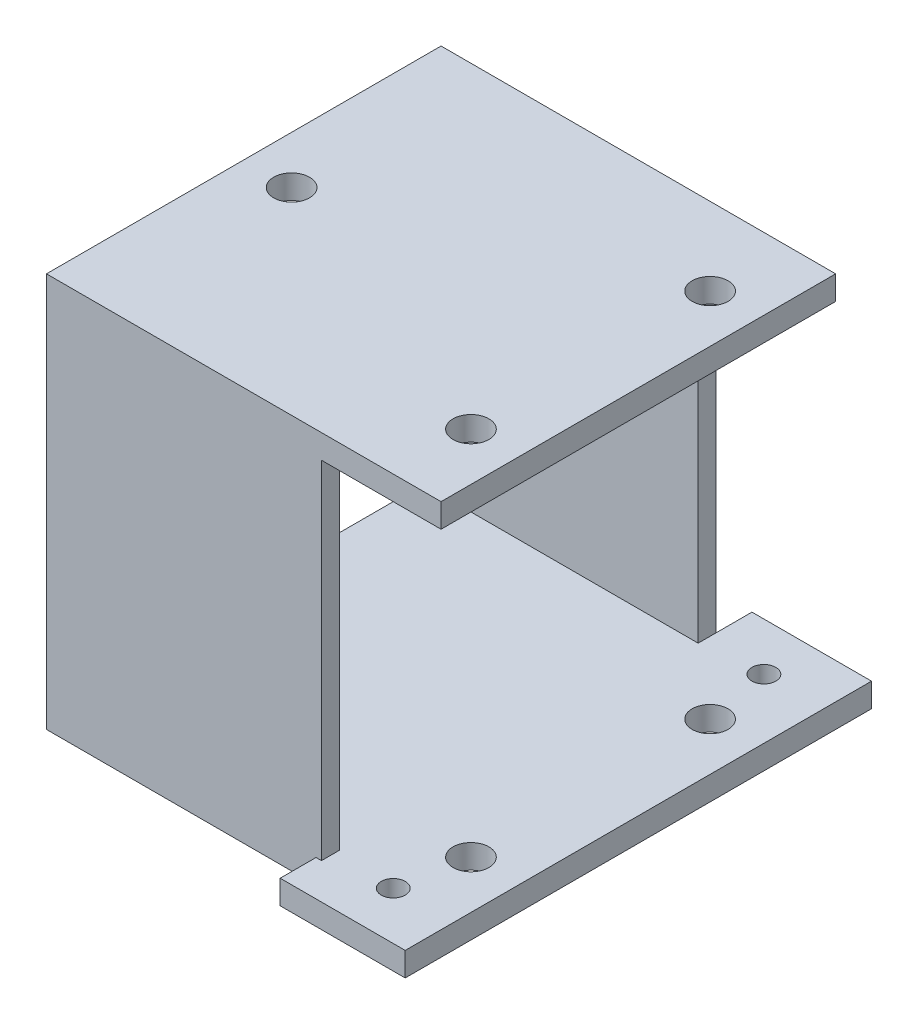
ISO-10303-21;
HEADER;
FILE_DESCRIPTION(('STEP AP214'),'2;1');
FILE_NAME('part.step','',(''),(''),'','','');
FILE_SCHEMA(('AUTOMOTIVE_DESIGN { 1 0 10303 214 1 1 1 1 }'));
ENDSEC;
DATA;
#1=APPLICATION_CONTEXT('core data for automotive mechanical design processes');
#2=APPLICATION_PROTOCOL_DEFINITION('international standard','automotive_design',2000,#1);
#3=PRODUCT_CONTEXT('',#1,'mechanical');
#4=PRODUCT('Part','Part','',(#3));
#5=PRODUCT_RELATED_PRODUCT_CATEGORY('part','',(#4));
#6=PRODUCT_DEFINITION_FORMATION('','',#4);
#7=PRODUCT_DEFINITION_CONTEXT('part definition',#1,'design');
#8=PRODUCT_DEFINITION('design','',#6,#7);
#9=PRODUCT_DEFINITION_SHAPE('','',#8);
#10=(LENGTH_UNIT() NAMED_UNIT(*) SI_UNIT(.MILLI.,.METRE.));
#11=(NAMED_UNIT(*) PLANE_ANGLE_UNIT() SI_UNIT($,.RADIAN.));
#12=(NAMED_UNIT(*) SI_UNIT($,.STERADIAN.) SOLID_ANGLE_UNIT());
#13=UNCERTAINTY_MEASURE_WITH_UNIT(LENGTH_MEASURE(1.E-05),#10,'distance_accuracy_value','');
#14=(GEOMETRIC_REPRESENTATION_CONTEXT(3) GLOBAL_UNCERTAINTY_ASSIGNED_CONTEXT((#13)) GLOBAL_UNIT_ASSIGNED_CONTEXT((#10,
#11,#12)) REPRESENTATION_CONTEXT('',''));
#15=CARTESIAN_POINT('',(0.,0.,0.));
#16=DIRECTION('',(0.,0.,1.));
#17=DIRECTION('',(1.,0.,0.));
#18=AXIS2_PLACEMENT_3D('',#15,#16,#17);
#19=CARTESIAN_POINT('',(-37.532221956558,2.,-8.54863581442362));
#20=DIRECTION('',(1.,0.,0.));
#21=DIRECTION('',(0.,0.,-1.));
#22=AXIS2_PLACEMENT_3D('',#19,#20,#21);
#23=PLANE('',#22);
#24=DIRECTION('',(0.,0.,1.));
#25=VECTOR('',#24,1.);
#26=CARTESIAN_POINT('',(-37.532221956558,31.,-8.54863581442362));
#27=LINE('',#26,#25);
#28=CARTESIAN_POINT('',(-37.532221956558,31.,-7.04863581442362));
#29=VERTEX_POINT('',#28);
#30=CARTESIAN_POINT('',(-37.532221956558,31.,22.9513641855764));
#31=VERTEX_POINT('',#30);
#32=EDGE_CURVE('E212',#29,#31,#27,.T.);
#33=ORIENTED_EDGE('',*,*,#32,.T.);
#34=DIRECTION('',(0.,1.,0.));
#35=VECTOR('',#34,1.);
#36=CARTESIAN_POINT('',(-37.532221956558,2.,22.9513641855764));
#37=LINE('',#36,#35);
#38=CARTESIAN_POINT('',(-37.532221956558,2.,22.9513641855764));
#39=VERTEX_POINT('',#38);
#40=EDGE_CURVE('E250',#39,#31,#37,.T.);
#41=ORIENTED_EDGE('',*,*,#40,.F.);
#42=DIRECTION('',(0.,0.,1.));
#43=VECTOR('',#42,1.);
#44=CARTESIAN_POINT('',(-37.532221956558,2.,-8.54863581442362));
#45=LINE('',#44,#43);
#46=CARTESIAN_POINT('',(-37.532221956558,2.,-7.04863581442362));
#47=VERTEX_POINT('',#46);
#48=EDGE_CURVE('E179',#47,#39,#45,.T.);
#49=ORIENTED_EDGE('',*,*,#48,.F.);
#50=DIRECTION('',(0.,1.,0.));
#51=VECTOR('',#50,1.);
#52=CARTESIAN_POINT('',(-37.532221956558,2.,-7.04863581442362));
#53=LINE('',#52,#51);
#54=EDGE_CURVE('E242',#47,#29,#53,.T.);
#55=ORIENTED_EDGE('',*,*,#54,.T.);
#56=EDGE_LOOP('',(#33,#41,#49,#55));
#57=FACE_BOUND('',#56,.T.);
#58=DIRECTION('',(0.,0.,1.));
#59=VECTOR('',#58,1.);
#60=CARTESIAN_POINT('',(-37.532221956558,0.,-8.54863581442362));
#61=LINE('',#60,#59);
#62=CARTESIAN_POINT('',(-37.532221956558,0.,-8.54863581442362));
#63=VERTEX_POINT('',#62);
#64=CARTESIAN_POINT('',(-37.532221956558,0.,24.4513641855764));
#65=VERTEX_POINT('',#64);
#66=EDGE_CURVE('E174',#63,#65,#61,.T.);
#67=ORIENTED_EDGE('',*,*,#66,.T.);
#68=DIRECTION('',(0.,-1.,0.));
#69=VECTOR('',#68,1.);
#70=CARTESIAN_POINT('',(-37.532221956558,2.,24.4513641855764));
#71=LINE('',#70,#69);
#72=CARTESIAN_POINT('',(-37.532221956558,33.,24.4513641855764));
#73=VERTEX_POINT('',#72);
#74=EDGE_CURVE('E169',#73,#65,#71,.T.);
#75=ORIENTED_EDGE('',*,*,#74,.F.);
#76=DIRECTION('',(0.,0.,1.));
#77=VECTOR('',#76,1.);
#78=CARTESIAN_POINT('',(-37.532221956558,33.,-8.54863581442362));
#79=LINE('',#78,#77);
#80=CARTESIAN_POINT('',(-37.532221956558,33.,-8.54863581442362));
#81=VERTEX_POINT('',#80);
#82=EDGE_CURVE('E172',#81,#73,#79,.T.);
#83=ORIENTED_EDGE('',*,*,#82,.F.);
#84=DIRECTION('',(0.,-1.,0.));
#85=VECTOR('',#84,1.);
#86=CARTESIAN_POINT('',(-37.532221956558,2.,-8.54863581442362));
#87=LINE('',#86,#85);
#88=EDGE_CURVE('E178',#81,#63,#87,.T.);
#89=ORIENTED_EDGE('',*,*,#88,.T.);
#90=EDGE_LOOP('',(#67,#75,#83,#89));
#91=FACE_BOUND('',#90,.T.);
#92=ADVANCED_FACE('F59',(#57,#91),#23,.F.);
#93=CARTESIAN_POINT('',(0.,0.,0.));
#94=DIRECTION('',(0.,-1.,0.));
#95=DIRECTION('',(0.,0.,-1.));
#96=AXIS2_PLACEMENT_3D('',#93,#94,#95);
#97=PLANE('',#96);
#98=CARTESIAN_POINT('',(-8.53222195655803,0.,17.9513641855764));
#99=DIRECTION('',(0.,-1.,0.));
#100=DIRECTION('',(0.,0.,-1.));
#101=AXIS2_PLACEMENT_3D('',#98,#99,#100);
#102=CIRCLE('',#101,1.5);
#103=CARTESIAN_POINT('',(-8.53222195655803,0.,16.4513641855764));
#104=VERTEX_POINT('',#103);
#105=EDGE_CURVE('E201',#104,#104,#102,.T.);
#106=ORIENTED_EDGE('',*,*,#105,.F.);
#107=EDGE_LOOP('',(#106));
#108=FACE_BOUND('',#107,.T.);
#109=CARTESIAN_POINT('',(-8.53222195655803,0.,-2.04863581442362));
#110=DIRECTION('',(0.,-1.,0.));
#111=DIRECTION('',(0.,0.,-1.));
#112=AXIS2_PLACEMENT_3D('',#109,#110,#111);
#113=CIRCLE('',#112,1.5);
#114=CARTESIAN_POINT('',(-8.53222195655803,0.,-3.54863581442362));
#115=VERTEX_POINT('',#114);
#116=EDGE_CURVE('E670',#115,#115,#113,.T.);
#117=ORIENTED_EDGE('',*,*,#116,.F.);
#118=EDGE_LOOP('',(#117));
#119=FACE_BOUND('',#118,.T.);
#120=CARTESIAN_POINT('',(-33.532221956558,0.,7.95136418557638));
#121=DIRECTION('',(0.,-1.,0.));
#122=DIRECTION('',(0.,0.,-1.));
#123=AXIS2_PLACEMENT_3D('',#120,#121,#122);
#124=CIRCLE('',#123,1.5);
#125=CARTESIAN_POINT('',(-33.532221956558,0.,6.45136418557638));
#126=VERTEX_POINT('',#125);
#127=EDGE_CURVE('E656',#126,#126,#124,.T.);
#128=ORIENTED_EDGE('',*,*,#127,.F.);
#129=EDGE_LOOP('',(#128));
#130=FACE_BOUND('',#129,.T.);
#131=CARTESIAN_POINT('',(-9.53222195655803,0.,-7.54863581442362));
#132=DIRECTION('',(0.,1.,0.));
#133=DIRECTION('',(0.,0.,1.));
#134=AXIS2_PLACEMENT_3D('',#131,#132,#133);
#135=CIRCLE('',#134,0.999999999999999);
#136=CARTESIAN_POINT('',(-9.53222195655803,0.,-6.54863581442362));
#137=VERTEX_POINT('',#136);
#138=EDGE_CURVE('E294',#137,#137,#135,.T.);
#139=ORIENTED_EDGE('',*,*,#138,.T.);
#140=EDGE_LOOP('',(#139));
#141=FACE_BOUND('',#140,.T.);
#142=CARTESIAN_POINT('',(-9.53222195655803,0.,23.4513641855764));
#143=DIRECTION('',(0.,1.,0.));
#144=DIRECTION('',(0.,0.,1.));
#145=AXIS2_PLACEMENT_3D('',#142,#143,#144);
#146=CIRCLE('',#145,1.);
#147=CARTESIAN_POINT('',(-9.53222195655803,0.,24.4513641855764));
#148=VERTEX_POINT('',#147);
#149=EDGE_CURVE('E301',#148,#148,#146,.T.);
#150=ORIENTED_EDGE('',*,*,#149,.T.);
#151=EDGE_LOOP('',(#150));
#152=FACE_BOUND('',#151,.T.);
#153=DIRECTION('',(1.,0.,0.));
#154=VECTOR('',#153,1.);
#155=CARTESIAN_POINT('',(-37.532221956558,0.,24.4513641855764));
#156=LINE('',#155,#154);
#157=CARTESIAN_POINT('',(-14.987647150552,0.,24.4513641855764));
#158=VERTEX_POINT('',#157);
#159=EDGE_CURVE('E310',#65,#158,#156,.T.);
#160=ORIENTED_EDGE('',*,*,#159,.F.);
#161=ORIENTED_EDGE('',*,*,#66,.F.);
#162=DIRECTION('',(1.,0.,0.));
#163=VECTOR('',#162,1.);
#164=CARTESIAN_POINT('',(-37.532221956558,0.,-8.54863581442362));
#165=LINE('',#164,#163);
#166=CARTESIAN_POINT('',(-14.532221956558,0.,-8.54863581442362));
#167=VERTEX_POINT('',#166);
#168=EDGE_CURVE('E330',#63,#167,#165,.T.);
#169=ORIENTED_EDGE('',*,*,#168,.T.);
#170=DIRECTION('',(0.,0.,1.));
#171=VECTOR('',#170,1.);
#172=CARTESIAN_POINT('',(-14.532221956558,0.,-11.5486358144236));
#173=LINE('',#172,#171);
#174=CARTESIAN_POINT('',(-14.532221956558,0.,-11.5486358144236));
#175=VERTEX_POINT('',#174);
#176=EDGE_CURVE('E297',#175,#167,#173,.T.);
#177=ORIENTED_EDGE('',*,*,#176,.F.);
#178=DIRECTION('',(1.,0.,0.));
#179=VECTOR('',#178,1.);
#180=CARTESIAN_POINT('',(-14.532221956558,0.,-11.5486358144236));
#181=LINE('',#180,#179);
#182=CARTESIAN_POINT('',(-4.53222195655803,0.,-11.5486358144236));
#183=VERTEX_POINT('',#182);
#184=EDGE_CURVE('E323',#175,#183,#181,.T.);
#185=ORIENTED_EDGE('',*,*,#184,.T.);
#186=DIRECTION('',(0.,0.,1.));
#187=VECTOR('',#186,1.);
#188=CARTESIAN_POINT('',(-4.53222195655803,0.,-8.54863581442362));
#189=LINE('',#188,#187);
#190=CARTESIAN_POINT('',(-4.53222195655803,0.,27.4513641855764));
#191=VERTEX_POINT('',#190);
#192=EDGE_CURVE('E337',#183,#191,#189,.T.);
#193=ORIENTED_EDGE('',*,*,#192,.T.);
#194=DIRECTION('',(1.,0.,0.));
#195=VECTOR('',#194,1.);
#196=CARTESIAN_POINT('',(-14.987647150552,0.,27.4513641855764));
#197=LINE('',#196,#195);
#198=CARTESIAN_POINT('',(-14.987647150552,0.,27.4513641855764));
#199=VERTEX_POINT('',#198);
#200=EDGE_CURVE('E344',#199,#191,#197,.T.);
#201=ORIENTED_EDGE('',*,*,#200,.F.);
#202=DIRECTION('',(0.,0.,1.));
#203=VECTOR('',#202,1.);
#204=CARTESIAN_POINT('',(-14.987647150552,0.,24.4513641855764));
#205=LINE('',#204,#203);
#206=EDGE_CURVE('E348',#158,#199,#205,.T.);
#207=ORIENTED_EDGE('',*,*,#206,.F.);
#208=EDGE_LOOP('',(#160,#161,#169,#177,#185,#193,#201,#207));
#209=FACE_BOUND('',#208,.T.);
#210=ADVANCED_FACE('F328',(#108,#119,#130,#141,#152,#209),#97,.T.);
#211=CARTESIAN_POINT('',(0.,2.,0.));
#212=DIRECTION('',(0.,-1.,0.));
#213=DIRECTION('',(0.,0.,-1.));
#214=AXIS2_PLACEMENT_3D('',#211,#212,#213);
#215=PLANE('',#214);
#216=CARTESIAN_POINT('',(-8.53222195655803,2.,17.9513641855764));
#217=DIRECTION('',(0.,-1.,0.));
#218=DIRECTION('',(0.,0.,-1.));
#219=AXIS2_PLACEMENT_3D('',#216,#217,#218);
#220=CIRCLE('',#219,1.5);
#221=CARTESIAN_POINT('',(-8.53222195655803,2.,16.4513641855764));
#222=VERTEX_POINT('',#221);
#223=EDGE_CURVE('E641',#222,#222,#220,.T.);
#224=ORIENTED_EDGE('',*,*,#223,.T.);
#225=EDGE_LOOP('',(#224));
#226=FACE_BOUND('',#225,.T.);
#227=CARTESIAN_POINT('',(-8.53222195655803,2.,-2.04863581442362));
#228=DIRECTION('',(0.,-1.,0.));
#229=DIRECTION('',(0.,0.,-1.));
#230=AXIS2_PLACEMENT_3D('',#227,#228,#229);
#231=CIRCLE('',#230,1.5);
#232=CARTESIAN_POINT('',(-8.53222195655803,2.,-3.54863581442362));
#233=VERTEX_POINT('',#232);
#234=EDGE_CURVE('E645',#233,#233,#231,.T.);
#235=ORIENTED_EDGE('',*,*,#234,.T.);
#236=EDGE_LOOP('',(#235));
#237=FACE_BOUND('',#236,.T.);
#238=CARTESIAN_POINT('',(-33.532221956558,2.,7.95136418557638));
#239=DIRECTION('',(0.,-1.,0.));
#240=DIRECTION('',(0.,0.,-1.));
#241=AXIS2_PLACEMENT_3D('',#238,#239,#240);
#242=CIRCLE('',#241,1.5);
#243=CARTESIAN_POINT('',(-33.532221956558,2.,6.45136418557638));
#244=VERTEX_POINT('',#243);
#245=EDGE_CURVE('E649',#244,#244,#242,.T.);
#246=ORIENTED_EDGE('',*,*,#245,.T.);
#247=EDGE_LOOP('',(#246));
#248=FACE_BOUND('',#247,.T.);
#249=CARTESIAN_POINT('',(-9.53222195655803,2.,-7.54863581442362));
#250=DIRECTION('',(0.,1.,0.));
#251=DIRECTION('',(0.,0.,1.));
#252=AXIS2_PLACEMENT_3D('',#249,#250,#251);
#253=CIRCLE('',#252,0.999999999999999);
#254=CARTESIAN_POINT('',(-9.53222195655803,2.,-6.54863581442362));
#255=VERTEX_POINT('',#254);
#256=EDGE_CURVE('E298',#255,#255,#253,.T.);
#257=ORIENTED_EDGE('',*,*,#256,.F.);
#258=EDGE_LOOP('',(#257));
#259=FACE_BOUND('',#258,.T.);
#260=CARTESIAN_POINT('',(-9.53222195655803,2.,23.4513641855764));
#261=DIRECTION('',(0.,1.,0.));
#262=DIRECTION('',(0.,0.,1.));
#263=AXIS2_PLACEMENT_3D('',#260,#261,#262);
#264=CIRCLE('',#263,1.);
#265=CARTESIAN_POINT('',(-9.53222195655803,2.,24.4513641855764));
#266=VERTEX_POINT('',#265);
#267=EDGE_CURVE('E265',#266,#266,#264,.T.);
#268=ORIENTED_EDGE('',*,*,#267,.F.);
#269=EDGE_LOOP('',(#268));
#270=FACE_BOUND('',#269,.T.);
#271=DIRECTION('',(0.,0.,1.));
#272=VECTOR('',#271,1.);
#273=CARTESIAN_POINT('',(-14.532221956558,2.,-11.5486358144236));
#274=LINE('',#273,#272);
#275=CARTESIAN_POINT('',(-14.532221956558,2.,-11.5486358144236));
#276=VERTEX_POINT('',#275);
#277=CARTESIAN_POINT('',(-14.532221956558,2.,-8.54863581442362));
#278=VERTEX_POINT('',#277);
#279=EDGE_CURVE('E319',#276,#278,#274,.T.);
#280=ORIENTED_EDGE('',*,*,#279,.T.);
#281=DIRECTION('',(0.,0.,-1.));
#282=VECTOR('',#281,1.);
#283=CARTESIAN_POINT('',(-14.532221956558,2.,-8.54863581442362));
#284=LINE('',#283,#282);
#285=CARTESIAN_POINT('',(-14.532221956558,2.,-7.04863581442362));
#286=VERTEX_POINT('',#285);
#287=EDGE_CURVE('E234',#286,#278,#284,.T.);
#288=ORIENTED_EDGE('',*,*,#287,.F.);
#289=DIRECTION('',(1.,0.,0.));
#290=VECTOR('',#289,1.);
#291=CARTESIAN_POINT('',(-14.532221956558,2.,-7.04863581442362));
#292=LINE('',#291,#290);
#293=EDGE_CURVE('E244',#47,#286,#292,.T.);
#294=ORIENTED_EDGE('',*,*,#293,.F.);
#295=ORIENTED_EDGE('',*,*,#48,.T.);
#296=DIRECTION('',(1.,0.,0.));
#297=VECTOR('',#296,1.);
#298=CARTESIAN_POINT('',(-37.532221956558,2.,22.9513641855764));
#299=LINE('',#298,#297);
#300=CARTESIAN_POINT('',(-14.532221956558,2.,22.9513641855764));
#301=VERTEX_POINT('',#300);
#302=EDGE_CURVE('E76',#39,#301,#299,.T.);
#303=ORIENTED_EDGE('',*,*,#302,.T.);
#304=DIRECTION('',(0.,0.,1.));
#305=VECTOR('',#304,1.);
#306=CARTESIAN_POINT('',(-14.532221956558,2.,22.9513641855764));
#307=LINE('',#306,#305);
#308=CARTESIAN_POINT('',(-14.532221956558,2.,24.4513641855764));
#309=VERTEX_POINT('',#308);
#310=EDGE_CURVE('E80',#301,#309,#307,.T.);
#311=ORIENTED_EDGE('',*,*,#310,.T.);
#312=DIRECTION('',(-1.,0.,0.));
#313=VECTOR('',#312,1.);
#314=CARTESIAN_POINT('',(-37.532221956558,2.,24.4513641855764));
#315=LINE('',#314,#313);
#316=CARTESIAN_POINT('',(-14.987647150552,2.,24.4513641855764));
#317=VERTEX_POINT('',#316);
#318=EDGE_CURVE('E284',#309,#317,#315,.T.);
#319=ORIENTED_EDGE('',*,*,#318,.T.);
#320=DIRECTION('',(0.,0.,1.));
#321=VECTOR('',#320,1.);
#322=CARTESIAN_POINT('',(-14.987647150552,2.,24.4513641855764));
#323=LINE('',#322,#321);
#324=CARTESIAN_POINT('',(-14.987647150552,2.,27.4513641855764));
#325=VERTEX_POINT('',#324);
#326=EDGE_CURVE('E340',#317,#325,#323,.T.);
#327=ORIENTED_EDGE('',*,*,#326,.T.);
#328=DIRECTION('',(1.,0.,0.));
#329=VECTOR('',#328,1.);
#330=CARTESIAN_POINT('',(-14.987647150552,2.,27.4513641855764));
#331=LINE('',#330,#329);
#332=CARTESIAN_POINT('',(-4.53222195655803,2.,27.4513641855764));
#333=VERTEX_POINT('',#332);
#334=EDGE_CURVE('E343',#325,#333,#331,.T.);
#335=ORIENTED_EDGE('',*,*,#334,.T.);
#336=DIRECTION('',(0.,0.,1.));
#337=VECTOR('',#336,1.);
#338=CARTESIAN_POINT('',(-4.53222195655803,2.,-8.54863581442362));
#339=LINE('',#338,#337);
#340=CARTESIAN_POINT('',(-4.53222195655803,2.,-11.5486358144236));
#341=VERTEX_POINT('',#340);
#342=EDGE_CURVE('E306',#341,#333,#339,.T.);
#343=ORIENTED_EDGE('',*,*,#342,.F.);
#344=DIRECTION('',(1.,0.,0.));
#345=VECTOR('',#344,1.);
#346=CARTESIAN_POINT('',(-14.532221956558,2.,-11.5486358144236));
#347=LINE('',#346,#345);
#348=EDGE_CURVE('E322',#276,#341,#347,.T.);
#349=ORIENTED_EDGE('',*,*,#348,.F.);
#350=EDGE_LOOP('',(#280,#288,#294,#295,#303,#311,#319,#327,#335,#343,#349));
#351=FACE_BOUND('',#350,.T.);
#352=ADVANCED_FACE('F376',(#226,#237,#248,#259,#270,#351),#215,.F.);
#353=CARTESIAN_POINT('',(-37.532221956558,2.,-8.54863581442362));
#354=DIRECTION('',(0.,0.,-1.));
#355=DIRECTION('',(-1.,0.,0.));
#356=AXIS2_PLACEMENT_3D('',#353,#354,#355);
#357=PLANE('',#356);
#358=ORIENTED_EDGE('',*,*,#88,.F.);
#359=DIRECTION('',(-1.,0.,0.));
#360=VECTOR('',#359,1.);
#361=CARTESIAN_POINT('',(-37.532221956558,33.,-8.54863581442362));
#362=LINE('',#361,#360);
#363=CARTESIAN_POINT('',(-4.53222195655803,33.,-8.54863581442362));
#364=VERTEX_POINT('',#363);
#365=EDGE_CURVE('E194',#364,#81,#362,.T.);
#366=ORIENTED_EDGE('',*,*,#365,.F.);
#367=DIRECTION('',(0.,-1.,0.));
#368=VECTOR('',#367,1.);
#369=CARTESIAN_POINT('',(-4.53222195655803,33.,-8.54863581442362));
#370=LINE('',#369,#368);
#371=CARTESIAN_POINT('',(-4.53222195655803,31.,-8.54863581442362));
#372=VERTEX_POINT('',#371);
#373=EDGE_CURVE('E206',#364,#372,#370,.T.);
#374=ORIENTED_EDGE('',*,*,#373,.T.);
#375=DIRECTION('',(-1.,0.,0.));
#376=VECTOR('',#375,1.);
#377=CARTESIAN_POINT('',(-37.532221956558,31.,-8.54863581442362));
#378=LINE('',#377,#376);
#379=CARTESIAN_POINT('',(-14.532221956558,31.,-8.54863581442362));
#380=VERTEX_POINT('',#379);
#381=EDGE_CURVE('E195',#372,#380,#378,.T.);
#382=ORIENTED_EDGE('',*,*,#381,.T.);
#383=DIRECTION('',(0.,1.,0.));
#384=VECTOR('',#383,1.);
#385=CARTESIAN_POINT('',(-14.532221956558,2.,-8.54863581442362));
#386=LINE('',#385,#384);
#387=EDGE_CURVE('E254',#278,#380,#386,.T.);
#388=ORIENTED_EDGE('',*,*,#387,.F.);
#389=DIRECTION('',(0.,-1.,0.));
#390=VECTOR('',#389,1.);
#391=CARTESIAN_POINT('',(-14.532221956558,2.,-8.54863581442362));
#392=LINE('',#391,#390);
#393=EDGE_CURVE('E68',#278,#167,#392,.T.);
#394=ORIENTED_EDGE('',*,*,#393,.T.);
#395=ORIENTED_EDGE('',*,*,#168,.F.);
#396=EDGE_LOOP('',(#358,#366,#374,#382,#388,#394,#395));
#397=FACE_BOUND('',#396,.T.);
#398=ADVANCED_FACE('F333',(#397),#357,.T.);
#399=CARTESIAN_POINT('',(-37.532221956558,2.,24.4513641855764));
#400=DIRECTION('',(0.,0.,-1.));
#401=DIRECTION('',(-1.,0.,0.));
#402=AXIS2_PLACEMENT_3D('',#399,#400,#401);
#403=PLANE('',#402);
#404=DIRECTION('',(0.,-1.,0.));
#405=VECTOR('',#404,1.);
#406=CARTESIAN_POINT('',(-14.987647150552,2.,24.4513641855764));
#407=LINE('',#406,#405);
#408=EDGE_CURVE('E13',#317,#158,#407,.T.);
#409=ORIENTED_EDGE('',*,*,#408,.F.);
#410=ORIENTED_EDGE('',*,*,#318,.F.);
#411=DIRECTION('',(0.,1.,0.));
#412=VECTOR('',#411,1.);
#413=CARTESIAN_POINT('',(-14.532221956558,2.,24.4513641855764));
#414=LINE('',#413,#412);
#415=CARTESIAN_POINT('',(-14.532221956558,31.,24.4513641855764));
#416=VERTEX_POINT('',#415);
#417=EDGE_CURVE('E261',#309,#416,#414,.T.);
#418=ORIENTED_EDGE('',*,*,#417,.T.);
#419=DIRECTION('',(1.,0.,0.));
#420=VECTOR('',#419,1.);
#421=CARTESIAN_POINT('',(-37.532221956558,31.,24.4513641855764));
#422=LINE('',#421,#420);
#423=CARTESIAN_POINT('',(-4.53222195655803,31.,24.4513641855764));
#424=VERTEX_POINT('',#423);
#425=EDGE_CURVE('E215',#416,#424,#422,.T.);
#426=ORIENTED_EDGE('',*,*,#425,.T.);
#427=DIRECTION('',(0.,-1.,0.));
#428=VECTOR('',#427,1.);
#429=CARTESIAN_POINT('',(-4.53222195655803,33.,24.4513641855764));
#430=LINE('',#429,#428);
#431=CARTESIAN_POINT('',(-4.53222195655803,33.,24.4513641855764));
#432=VERTEX_POINT('',#431);
#433=EDGE_CURVE('E186',#432,#424,#430,.T.);
#434=ORIENTED_EDGE('',*,*,#433,.F.);
#435=DIRECTION('',(1.,0.,0.));
#436=VECTOR('',#435,1.);
#437=CARTESIAN_POINT('',(-37.532221956558,33.,24.4513641855764));
#438=LINE('',#437,#436);
#439=EDGE_CURVE('E182',#73,#432,#438,.T.);
#440=ORIENTED_EDGE('',*,*,#439,.F.);
#441=ORIENTED_EDGE('',*,*,#74,.T.);
#442=ORIENTED_EDGE('',*,*,#159,.T.);
#443=EDGE_LOOP('',(#409,#410,#418,#426,#434,#440,#441,#442));
#444=FACE_BOUND('',#443,.T.);
#445=ADVANCED_FACE('F184',(#444),#403,.F.);
#446=CARTESIAN_POINT('',(-4.53222195655803,2.,-8.54863581442362));
#447=DIRECTION('',(1.,0.,0.));
#448=DIRECTION('',(0.,0.,-1.));
#449=AXIS2_PLACEMENT_3D('',#446,#447,#448);
#450=PLANE('',#449);
#451=ORIENTED_EDGE('',*,*,#192,.F.);
#452=DIRECTION('',(0.,-1.,0.));
#453=VECTOR('',#452,1.);
#454=CARTESIAN_POINT('',(-4.53222195655803,2.,-11.5486358144236));
#455=LINE('',#454,#453);
#456=EDGE_CURVE('E351',#341,#183,#455,.T.);
#457=ORIENTED_EDGE('',*,*,#456,.F.);
#458=ORIENTED_EDGE('',*,*,#342,.T.);
#459=DIRECTION('',(0.,-1.,0.));
#460=VECTOR('',#459,1.);
#461=CARTESIAN_POINT('',(-4.53222195655803,2.,27.4513641855764));
#462=LINE('',#461,#460);
#463=EDGE_CURVE('E347',#333,#191,#462,.T.);
#464=ORIENTED_EDGE('',*,*,#463,.T.);
#465=EDGE_LOOP('',(#451,#457,#458,#464));
#466=FACE_BOUND('',#465,.T.);
#467=ADVANCED_FACE('F378',(#466),#450,.T.);
#468=CARTESIAN_POINT('',(-14.532221956558,2.,-11.5486358144236));
#469=DIRECTION('',(0.,0.,-1.));
#470=DIRECTION('',(-1.,0.,0.));
#471=AXIS2_PLACEMENT_3D('',#468,#469,#470);
#472=PLANE('',#471);
#473=ORIENTED_EDGE('',*,*,#184,.F.);
#474=DIRECTION('',(0.,-1.,0.));
#475=VECTOR('',#474,1.);
#476=CARTESIAN_POINT('',(-14.532221956558,2.,-11.5486358144236));
#477=LINE('',#476,#475);
#478=EDGE_CURVE('E361',#276,#175,#477,.T.);
#479=ORIENTED_EDGE('',*,*,#478,.F.);
#480=ORIENTED_EDGE('',*,*,#348,.T.);
#481=ORIENTED_EDGE('',*,*,#456,.T.);
#482=EDGE_LOOP('',(#473,#479,#480,#481));
#483=FACE_BOUND('',#482,.T.);
#484=ADVANCED_FACE('F370',(#483),#472,.T.);
#485=CARTESIAN_POINT('',(-14.532221956558,2.,-11.5486358144236));
#486=DIRECTION('',(1.,0.,0.));
#487=DIRECTION('',(0.,0.,-1.));
#488=AXIS2_PLACEMENT_3D('',#485,#486,#487);
#489=PLANE('',#488);
#490=ORIENTED_EDGE('',*,*,#176,.T.);
#491=ORIENTED_EDGE('',*,*,#393,.F.);
#492=ORIENTED_EDGE('',*,*,#279,.F.);
#493=ORIENTED_EDGE('',*,*,#478,.T.);
#494=EDGE_LOOP('',(#490,#491,#492,#493));
#495=FACE_BOUND('',#494,.T.);
#496=ADVANCED_FACE('F61',(#495),#489,.F.);
#497=CARTESIAN_POINT('',(-14.987647150552,2.,27.4513641855764));
#498=DIRECTION('',(0.,0.,-1.));
#499=DIRECTION('',(-1.,0.,0.));
#500=AXIS2_PLACEMENT_3D('',#497,#498,#499);
#501=PLANE('',#500);
#502=ORIENTED_EDGE('',*,*,#200,.T.);
#503=ORIENTED_EDGE('',*,*,#463,.F.);
#504=ORIENTED_EDGE('',*,*,#334,.F.);
#505=DIRECTION('',(0.,-1.,0.));
#506=VECTOR('',#505,1.);
#507=CARTESIAN_POINT('',(-14.987647150552,2.,27.4513641855764));
#508=LINE('',#507,#506);
#509=EDGE_CURVE('E356',#325,#199,#508,.T.);
#510=ORIENTED_EDGE('',*,*,#509,.T.);
#511=EDGE_LOOP('',(#502,#503,#504,#510));
#512=FACE_BOUND('',#511,.T.);
#513=ADVANCED_FACE('F380',(#512),#501,.F.);
#514=CARTESIAN_POINT('',(-14.987647150552,2.,24.4513641855764));
#515=DIRECTION('',(1.,0.,0.));
#516=DIRECTION('',(0.,0.,-1.));
#517=AXIS2_PLACEMENT_3D('',#514,#515,#516);
#518=PLANE('',#517);
#519=ORIENTED_EDGE('',*,*,#206,.T.);
#520=ORIENTED_EDGE('',*,*,#509,.F.);
#521=ORIENTED_EDGE('',*,*,#326,.F.);
#522=ORIENTED_EDGE('',*,*,#408,.T.);
#523=EDGE_LOOP('',(#519,#520,#521,#522));
#524=FACE_BOUND('',#523,.T.);
#525=ADVANCED_FACE('F384',(#524),#518,.F.);
#526=CARTESIAN_POINT('',(-9.53222195655803,0.,23.4513641855764));
#527=DIRECTION('',(0.,1.,0.));
#528=DIRECTION('',(0.,0.,1.));
#529=AXIS2_PLACEMENT_3D('',#526,#527,#528);
#530=CYLINDRICAL_SURFACE('',#529,1.);
#531=ORIENTED_EDGE('',*,*,#149,.F.);
#532=EDGE_LOOP('',(#531));
#533=FACE_BOUND('',#532,.T.);
#534=ORIENTED_EDGE('',*,*,#267,.T.);
#535=EDGE_LOOP('',(#534));
#536=FACE_BOUND('',#535,.T.);
#537=ADVANCED_FACE('F386',(#533,#536),#530,.F.);
#538=CARTESIAN_POINT('',(-9.53222195655803,0.,-7.54863581442362));
#539=DIRECTION('',(0.,1.,0.));
#540=DIRECTION('',(0.,0.,1.));
#541=AXIS2_PLACEMENT_3D('',#538,#539,#540);
#542=CYLINDRICAL_SURFACE('',#541,0.999999999999999);
#543=ORIENTED_EDGE('',*,*,#138,.F.);
#544=EDGE_LOOP('',(#543));
#545=FACE_BOUND('',#544,.T.);
#546=ORIENTED_EDGE('',*,*,#256,.T.);
#547=EDGE_LOOP('',(#546));
#548=FACE_BOUND('',#547,.T.);
#549=ADVANCED_FACE('F392',(#545,#548),#542,.F.);
#550=CARTESIAN_POINT('',(-14.532221956558,2.,22.9513641855764));
#551=DIRECTION('',(-1.,0.,0.));
#552=DIRECTION('',(0.,0.,1.));
#553=AXIS2_PLACEMENT_3D('',#550,#551,#552);
#554=PLANE('',#553);
#555=DIRECTION('',(0.,0.,1.));
#556=VECTOR('',#555,1.);
#557=CARTESIAN_POINT('',(-14.532221956558,31.,22.9513641855764));
#558=LINE('',#557,#556);
#559=CARTESIAN_POINT('',(-14.532221956558,31.,22.9513641855764));
#560=VERTEX_POINT('',#559);
#561=EDGE_CURVE('E272',#560,#416,#558,.T.);
#562=ORIENTED_EDGE('',*,*,#561,.T.);
#563=ORIENTED_EDGE('',*,*,#417,.F.);
#564=ORIENTED_EDGE('',*,*,#310,.F.);
#565=DIRECTION('',(0.,1.,0.));
#566=VECTOR('',#565,1.);
#567=CARTESIAN_POINT('',(-14.532221956558,2.,22.9513641855764));
#568=LINE('',#567,#566);
#569=EDGE_CURVE('E269',#301,#560,#568,.T.);
#570=ORIENTED_EDGE('',*,*,#569,.T.);
#571=EDGE_LOOP('',(#562,#563,#564,#570));
#572=FACE_BOUND('',#571,.T.);
#573=ADVANCED_FACE('F453',(#572),#554,.F.);
#574=CARTESIAN_POINT('',(-37.532221956558,2.,22.9513641855764));
#575=DIRECTION('',(0.,0.,1.));
#576=DIRECTION('',(1.,0.,0.));
#577=AXIS2_PLACEMENT_3D('',#574,#575,#576);
#578=PLANE('',#577);
#579=DIRECTION('',(1.,0.,0.));
#580=VECTOR('',#579,1.);
#581=CARTESIAN_POINT('',(-37.532221956558,31.,22.9513641855764));
#582=LINE('',#581,#580);
#583=EDGE_CURVE('E266',#31,#560,#582,.T.);
#584=ORIENTED_EDGE('',*,*,#583,.T.);
#585=ORIENTED_EDGE('',*,*,#569,.F.);
#586=ORIENTED_EDGE('',*,*,#302,.F.);
#587=ORIENTED_EDGE('',*,*,#40,.T.);
#588=EDGE_LOOP('',(#584,#585,#586,#587));
#589=FACE_BOUND('',#588,.T.);
#590=ADVANCED_FACE('F456',(#589),#578,.F.);
#591=CARTESIAN_POINT('',(-14.532221956558,2.,-8.54863581442362));
#592=DIRECTION('',(1.,0.,0.));
#593=DIRECTION('',(0.,0.,-1.));
#594=AXIS2_PLACEMENT_3D('',#591,#592,#593);
#595=PLANE('',#594);
#596=DIRECTION('',(0.,0.,-1.));
#597=VECTOR('',#596,1.);
#598=CARTESIAN_POINT('',(-14.532221956558,31.,-8.54863581442362));
#599=LINE('',#598,#597);
#600=CARTESIAN_POINT('',(-14.532221956558,31.,-7.04863581442362));
#601=VERTEX_POINT('',#600);
#602=EDGE_CURVE('E225',#601,#380,#599,.T.);
#603=ORIENTED_EDGE('',*,*,#602,.F.);
#604=DIRECTION('',(0.,1.,0.));
#605=VECTOR('',#604,1.);
#606=CARTESIAN_POINT('',(-14.532221956558,2.,-7.04863581442362));
#607=LINE('',#606,#605);
#608=EDGE_CURVE('E229',#286,#601,#607,.T.);
#609=ORIENTED_EDGE('',*,*,#608,.F.);
#610=ORIENTED_EDGE('',*,*,#287,.T.);
#611=ORIENTED_EDGE('',*,*,#387,.T.);
#612=EDGE_LOOP('',(#603,#609,#610,#611));
#613=FACE_BOUND('',#612,.T.);
#614=ADVANCED_FACE('F472',(#613),#595,.T.);
#615=CARTESIAN_POINT('',(-14.532221956558,2.,-7.04863581442362));
#616=DIRECTION('',(0.,0.,1.));
#617=DIRECTION('',(1.,0.,0.));
#618=AXIS2_PLACEMENT_3D('',#615,#616,#617);
#619=PLANE('',#618);
#620=DIRECTION('',(1.,0.,0.));
#621=VECTOR('',#620,1.);
#622=CARTESIAN_POINT('',(-14.532221956558,31.,-7.04863581442362));
#623=LINE('',#622,#621);
#624=EDGE_CURVE('E245',#29,#601,#623,.T.);
#625=ORIENTED_EDGE('',*,*,#624,.F.);
#626=ORIENTED_EDGE('',*,*,#54,.F.);
#627=ORIENTED_EDGE('',*,*,#293,.T.);
#628=ORIENTED_EDGE('',*,*,#608,.T.);
#629=EDGE_LOOP('',(#625,#626,#627,#628));
#630=FACE_BOUND('',#629,.T.);
#631=ADVANCED_FACE('F466',(#630),#619,.T.);
#632=CARTESIAN_POINT('',(0.,31.,0.));
#633=DIRECTION('',(0.,1.,0.));
#634=DIRECTION('',(0.,0.,1.));
#635=AXIS2_PLACEMENT_3D('',#632,#633,#634);
#636=PLANE('',#635);
#637=CARTESIAN_POINT('',(-8.53222195655803,31.,17.9513641855764));
#638=DIRECTION('',(0.,1.,0.));
#639=DIRECTION('',(0.,0.,1.));
#640=AXIS2_PLACEMENT_3D('',#637,#638,#639);
#641=CIRCLE('',#640,1.5);
#642=CARTESIAN_POINT('',(-8.53222195655803,31.,19.4513641855764));
#643=VERTEX_POINT('',#642);
#644=EDGE_CURVE('E673',#643,#643,#641,.T.);
#645=ORIENTED_EDGE('',*,*,#644,.T.);
#646=EDGE_LOOP('',(#645));
#647=FACE_BOUND('',#646,.T.);
#648=CARTESIAN_POINT('',(-8.53222195655803,31.,-2.04863581442362));
#649=DIRECTION('',(0.,1.,0.));
#650=DIRECTION('',(0.,0.,1.));
#651=AXIS2_PLACEMENT_3D('',#648,#649,#650);
#652=CIRCLE('',#651,1.5);
#653=CARTESIAN_POINT('',(-8.53222195655803,31.,-0.548635814423618));
#654=VERTEX_POINT('',#653);
#655=EDGE_CURVE('E660',#654,#654,#652,.T.);
#656=ORIENTED_EDGE('',*,*,#655,.T.);
#657=EDGE_LOOP('',(#656));
#658=FACE_BOUND('',#657,.T.);
#659=CARTESIAN_POINT('',(-33.532221956558,31.,7.95136418557638));
#660=DIRECTION('',(0.,1.,0.));
#661=DIRECTION('',(0.,0.,1.));
#662=AXIS2_PLACEMENT_3D('',#659,#660,#661);
#663=CIRCLE('',#662,1.5);
#664=CARTESIAN_POINT('',(-33.532221956558,31.,9.45136418557639));
#665=VERTEX_POINT('',#664);
#666=EDGE_CURVE('E657',#665,#665,#663,.T.);
#667=ORIENTED_EDGE('',*,*,#666,.T.);
#668=EDGE_LOOP('',(#667));
#669=FACE_BOUND('',#668,.T.);
#670=ORIENTED_EDGE('',*,*,#425,.F.);
#671=ORIENTED_EDGE('',*,*,#561,.F.);
#672=ORIENTED_EDGE('',*,*,#583,.F.);
#673=ORIENTED_EDGE('',*,*,#32,.F.);
#674=ORIENTED_EDGE('',*,*,#624,.T.);
#675=ORIENTED_EDGE('',*,*,#602,.T.);
#676=ORIENTED_EDGE('',*,*,#381,.F.);
#677=DIRECTION('',(0.,0.,-1.));
#678=VECTOR('',#677,1.);
#679=CARTESIAN_POINT('',(-4.53222195655803,31.,-8.54863581442362));
#680=LINE('',#679,#678);
#681=EDGE_CURVE('E198',#424,#372,#680,.T.);
#682=ORIENTED_EDGE('',*,*,#681,.F.);
#683=EDGE_LOOP('',(#670,#671,#672,#673,#674,#675,#676,#682));
#684=FACE_BOUND('',#683,.T.);
#685=ADVANCED_FACE('F482',(#647,#658,#669,#684),#636,.F.);
#686=CARTESIAN_POINT('',(-4.53222195655803,33.,-8.54863581442362));
#687=DIRECTION('',(-1.,0.,0.));
#688=DIRECTION('',(0.,0.,1.));
#689=AXIS2_PLACEMENT_3D('',#686,#687,#688);
#690=PLANE('',#689);
#691=ORIENTED_EDGE('',*,*,#681,.T.);
#692=ORIENTED_EDGE('',*,*,#373,.F.);
#693=DIRECTION('',(0.,0.,-1.));
#694=VECTOR('',#693,1.);
#695=CARTESIAN_POINT('',(-4.53222195655803,33.,-8.54863581442362));
#696=LINE('',#695,#694);
#697=EDGE_CURVE('E189',#432,#364,#696,.T.);
#698=ORIENTED_EDGE('',*,*,#697,.F.);
#699=ORIENTED_EDGE('',*,*,#433,.T.);
#700=EDGE_LOOP('',(#691,#692,#698,#699));
#701=FACE_BOUND('',#700,.T.);
#702=ADVANCED_FACE('F496',(#701),#690,.F.);
#703=CARTESIAN_POINT('',(0.,33.,0.));
#704=DIRECTION('',(0.,1.,0.));
#705=DIRECTION('',(0.,0.,1.));
#706=AXIS2_PLACEMENT_3D('',#703,#704,#705);
#707=PLANE('',#706);
#708=CARTESIAN_POINT('',(-8.53222195655803,33.,17.9513641855764));
#709=DIRECTION('',(0.,1.,0.));
#710=DIRECTION('',(0.,0.,1.));
#711=AXIS2_PLACEMENT_3D('',#708,#709,#710);
#712=CIRCLE('',#711,1.5);
#713=CARTESIAN_POINT('',(-8.53222195655803,33.,19.4513641855764));
#714=VERTEX_POINT('',#713);
#715=EDGE_CURVE('E663',#714,#714,#712,.T.);
#716=ORIENTED_EDGE('',*,*,#715,.F.);
#717=EDGE_LOOP('',(#716));
#718=FACE_BOUND('',#717,.T.);
#719=CARTESIAN_POINT('',(-8.53222195655803,33.,-2.04863581442362));
#720=DIRECTION('',(0.,1.,0.));
#721=DIRECTION('',(0.,0.,1.));
#722=AXIS2_PLACEMENT_3D('',#719,#720,#721);
#723=CIRCLE('',#722,1.5);
#724=CARTESIAN_POINT('',(-8.53222195655803,33.,-0.548635814423618));
#725=VERTEX_POINT('',#724);
#726=EDGE_CURVE('E706',#725,#725,#723,.T.);
#727=ORIENTED_EDGE('',*,*,#726,.F.);
#728=EDGE_LOOP('',(#727));
#729=FACE_BOUND('',#728,.T.);
#730=CARTESIAN_POINT('',(-33.532221956558,33.,7.95136418557638));
#731=DIRECTION('',(0.,1.,0.));
#732=DIRECTION('',(0.,0.,1.));
#733=AXIS2_PLACEMENT_3D('',#730,#731,#732);
#734=CIRCLE('',#733,1.5);
#735=CARTESIAN_POINT('',(-33.532221956558,33.,9.45136418557639));
#736=VERTEX_POINT('',#735);
#737=EDGE_CURVE('E703',#736,#736,#734,.T.);
#738=ORIENTED_EDGE('',*,*,#737,.F.);
#739=EDGE_LOOP('',(#738));
#740=FACE_BOUND('',#739,.T.);
#741=ORIENTED_EDGE('',*,*,#82,.T.);
#742=ORIENTED_EDGE('',*,*,#439,.T.);
#743=ORIENTED_EDGE('',*,*,#697,.T.);
#744=ORIENTED_EDGE('',*,*,#365,.T.);
#745=EDGE_LOOP('',(#741,#742,#743,#744));
#746=FACE_BOUND('',#745,.T.);
#747=ADVANCED_FACE('F192',(#718,#729,#740,#746),#707,.T.);
#748=CARTESIAN_POINT('',(-33.532221956558,-2.50000000007189E-05,7.95136418557638));
#749=DIRECTION('',(0.,1.,0.));
#750=DIRECTION('',(0.,0.,1.));
#751=AXIS2_PLACEMENT_3D('',#748,#749,#750);
#752=CYLINDRICAL_SURFACE('',#751,1.5);
#753=ORIENTED_EDGE('',*,*,#737,.T.);
#754=EDGE_LOOP('',(#753));
#755=FACE_BOUND('',#754,.T.);
#756=ORIENTED_EDGE('',*,*,#666,.F.);
#757=EDGE_LOOP('',(#756));
#758=FACE_BOUND('',#757,.T.);
#759=ADVANCED_FACE('F511',(#755,#758),#752,.F.);
#760=CARTESIAN_POINT('',(-8.53222195655803,-2.50000000007189E-05,-2.04863581442362));
#761=DIRECTION('',(0.,1.,0.));
#762=DIRECTION('',(0.,0.,1.));
#763=AXIS2_PLACEMENT_3D('',#760,#761,#762);
#764=CYLINDRICAL_SURFACE('',#763,1.5);
#765=ORIENTED_EDGE('',*,*,#726,.T.);
#766=EDGE_LOOP('',(#765));
#767=FACE_BOUND('',#766,.T.);
#768=ORIENTED_EDGE('',*,*,#655,.F.);
#769=EDGE_LOOP('',(#768));
#770=FACE_BOUND('',#769,.T.);
#771=ADVANCED_FACE('F519',(#767,#770),#764,.F.);
#772=CARTESIAN_POINT('',(-8.53222195655803,-2.50000000007189E-05,17.9513641855764));
#773=DIRECTION('',(0.,1.,0.));
#774=DIRECTION('',(0.,0.,1.));
#775=AXIS2_PLACEMENT_3D('',#772,#773,#774);
#776=CYLINDRICAL_SURFACE('',#775,1.5);
#777=ORIENTED_EDGE('',*,*,#715,.T.);
#778=EDGE_LOOP('',(#777));
#779=FACE_BOUND('',#778,.T.);
#780=ORIENTED_EDGE('',*,*,#644,.F.);
#781=EDGE_LOOP('',(#780));
#782=FACE_BOUND('',#781,.T.);
#783=ADVANCED_FACE('F528',(#779,#782),#776,.F.);
#784=ORIENTED_EDGE('',*,*,#127,.T.);
#785=EDGE_LOOP('',(#784));
#786=FACE_BOUND('',#785,.T.);
#787=ORIENTED_EDGE('',*,*,#245,.F.);
#788=EDGE_LOOP('',(#787));
#789=FACE_BOUND('',#788,.T.);
#790=ADVANCED_FACE('F522',(#786,#789),#752,.F.);
#791=ORIENTED_EDGE('',*,*,#116,.T.);
#792=EDGE_LOOP('',(#791));
#793=FACE_BOUND('',#792,.T.);
#794=ORIENTED_EDGE('',*,*,#234,.F.);
#795=EDGE_LOOP('',(#794));
#796=FACE_BOUND('',#795,.T.);
#797=ADVANCED_FACE('F531',(#793,#796),#764,.F.);
#798=ORIENTED_EDGE('',*,*,#105,.T.);
#799=EDGE_LOOP('',(#798));
#800=FACE_BOUND('',#799,.T.);
#801=ORIENTED_EDGE('',*,*,#223,.F.);
#802=EDGE_LOOP('',(#801));
#803=FACE_BOUND('',#802,.T.);
#804=ADVANCED_FACE('F539',(#800,#803),#776,.F.);
#805=CLOSED_SHELL('',(#92,#210,#352,#398,#445,#467,#484,#496,#513,#525,#537,#549,#573,#590,#614,
#631,#685,#702,#747,#759,#771,#783,#790,#797,#804));
#806=MANIFOLD_SOLID_BREP('B2',#805);
#807=ADVANCED_BREP_SHAPE_REPRESENTATION('',(#18,#806),#14);
#808=SHAPE_DEFINITION_REPRESENTATION(#9,#807);
ENDSEC;
END-ISO-10303-21;
